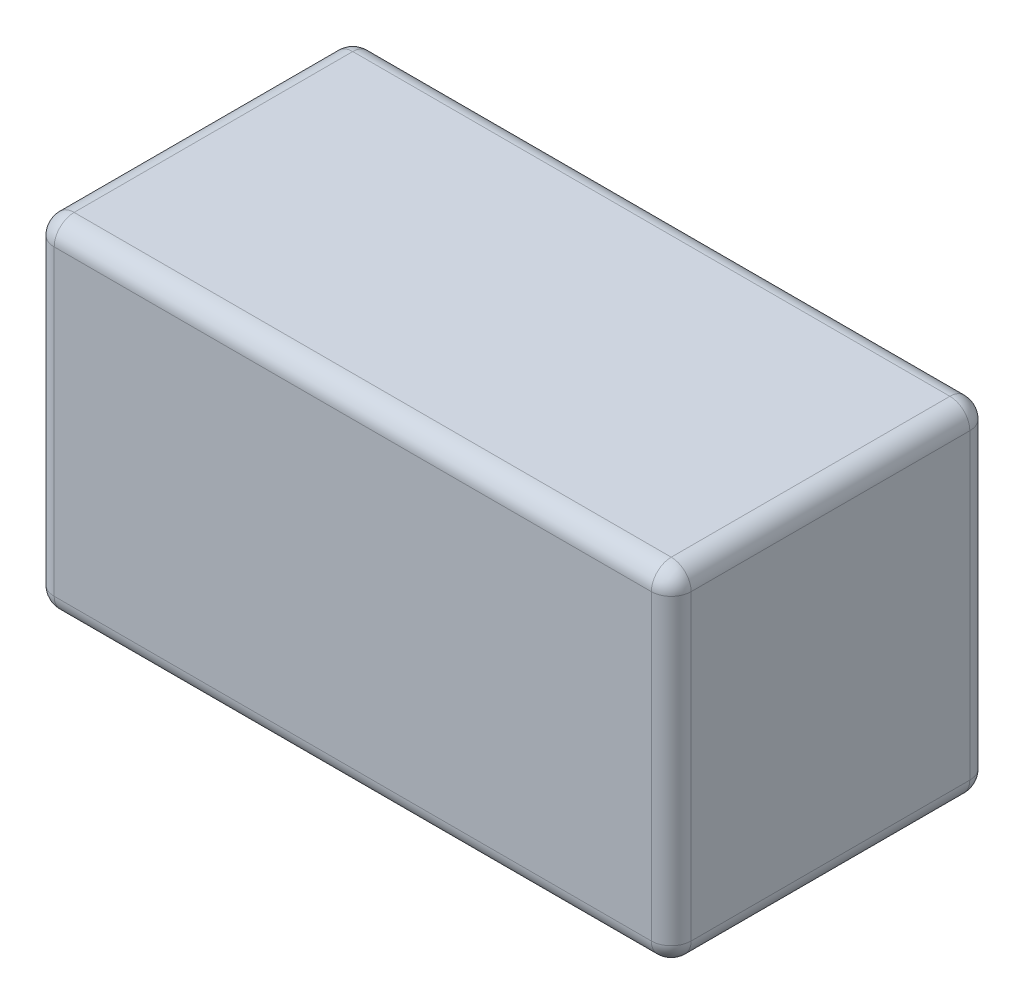
ISO-10303-21;
HEADER;
FILE_DESCRIPTION(('STEP AP214'),'2;1');
FILE_NAME('part.step','',(''),(''),'','','');
FILE_SCHEMA(('AUTOMOTIVE_DESIGN { 1 0 10303 214 1 1 1 1 }'));
ENDSEC;
DATA;
#1=APPLICATION_CONTEXT('core data for automotive mechanical design processes');
#2=APPLICATION_PROTOCOL_DEFINITION('international standard','automotive_design',2000,#1);
#3=PRODUCT_CONTEXT('',#1,'mechanical');
#4=PRODUCT('Part','Part','',(#3));
#5=PRODUCT_RELATED_PRODUCT_CATEGORY('part','',(#4));
#6=PRODUCT_DEFINITION_FORMATION('','',#4);
#7=PRODUCT_DEFINITION_CONTEXT('part definition',#1,'design');
#8=PRODUCT_DEFINITION('design','',#6,#7);
#9=PRODUCT_DEFINITION_SHAPE('','',#8);
#10=(LENGTH_UNIT() NAMED_UNIT(*) SI_UNIT(.MILLI.,.METRE.));
#11=(NAMED_UNIT(*) PLANE_ANGLE_UNIT() SI_UNIT($,.RADIAN.));
#12=(NAMED_UNIT(*) SI_UNIT($,.STERADIAN.) SOLID_ANGLE_UNIT());
#13=UNCERTAINTY_MEASURE_WITH_UNIT(LENGTH_MEASURE(1.E-05),#10,'distance_accuracy_value','');
#14=(GEOMETRIC_REPRESENTATION_CONTEXT(3) GLOBAL_UNCERTAINTY_ASSIGNED_CONTEXT((#13)) GLOBAL_UNIT_ASSIGNED_CONTEXT((#10,
#11,#12)) REPRESENTATION_CONTEXT('',''));
#15=CARTESIAN_POINT('',(0.,0.,0.));
#16=DIRECTION('',(0.,0.,1.));
#17=DIRECTION('',(1.,0.,0.));
#18=AXIS2_PLACEMENT_3D('',#15,#16,#17);
#19=CARTESIAN_POINT('',(0.75,0.81,0.35));
#20=DIRECTION('',(1.,0.,0.));
#21=DIRECTION('',(0.,0.,-1.));
#22=AXIS2_PLACEMENT_3D('',#19,#20,#21);
#23=SPHERICAL_SURFACE('',#22,0.05);
#24=CARTESIAN_POINT('',(0.75,0.81,0.35));
#25=DIRECTION('',(0.,-1.,0.));
#26=DIRECTION('',(0.,0.,-1.));
#27=AXIS2_PLACEMENT_3D('',#24,#25,#26);
#28=CIRCLE('',#27,0.05);
#29=CARTESIAN_POINT('',(0.8,0.81,0.35));
#30=VERTEX_POINT('',#29);
#31=CARTESIAN_POINT('',(0.75,0.81,0.4));
#32=VERTEX_POINT('',#31);
#33=EDGE_CURVE('E122',#30,#32,#28,.T.);
#34=ORIENTED_EDGE('',*,*,#33,.F.);
#35=CARTESIAN_POINT('',(0.75,0.81,0.35));
#36=DIRECTION('',(0.,0.,-1.));
#37=DIRECTION('',(-1.,0.,0.));
#38=AXIS2_PLACEMENT_3D('',#35,#36,#37);
#39=CIRCLE('',#38,0.05);
#40=CARTESIAN_POINT('',(0.75,0.86,0.35));
#41=VERTEX_POINT('',#40);
#42=EDGE_CURVE('E131',#41,#30,#39,.T.);
#43=ORIENTED_EDGE('',*,*,#42,.F.);
#44=CARTESIAN_POINT('',(0.75,0.81,0.35));
#45=DIRECTION('',(1.,0.,0.));
#46=DIRECTION('',(0.,0.,-1.));
#47=AXIS2_PLACEMENT_3D('',#44,#45,#46);
#48=CIRCLE('',#47,0.05);
#49=EDGE_CURVE('E111',#32,#41,#48,.F.);
#50=ORIENTED_EDGE('',*,*,#49,.F.);
#51=EDGE_LOOP('',(#34,#43,#50));
#52=FACE_BOUND('',#51,.T.);
#53=ADVANCED_FACE('F17',(#52),#23,.T.);
#54=CARTESIAN_POINT('',(-0.75,0.81,0.35));
#55=DIRECTION('',(1.,0.,0.));
#56=DIRECTION('',(0.,0.,-1.));
#57=AXIS2_PLACEMENT_3D('',#54,#55,#56);
#58=SPHERICAL_SURFACE('',#57,0.05);
#59=CARTESIAN_POINT('',(-0.75,0.81,0.35));
#60=DIRECTION('',(0.,-1.,0.));
#61=DIRECTION('',(0.,0.,-1.));
#62=AXIS2_PLACEMENT_3D('',#59,#60,#61);
#63=CIRCLE('',#62,0.05);
#64=CARTESIAN_POINT('',(-0.75,0.81,0.4));
#65=VERTEX_POINT('',#64);
#66=CARTESIAN_POINT('',(-0.8,0.81,0.35));
#67=VERTEX_POINT('',#66);
#68=EDGE_CURVE('E266',#65,#67,#63,.T.);
#69=ORIENTED_EDGE('',*,*,#68,.F.);
#70=CARTESIAN_POINT('',(-0.75,0.81,0.35));
#71=DIRECTION('',(1.,0.,0.));
#72=DIRECTION('',(0.,0.,-1.));
#73=AXIS2_PLACEMENT_3D('',#70,#71,#72);
#74=CIRCLE('',#73,0.05);
#75=CARTESIAN_POINT('',(-0.75,0.86,0.35));
#76=VERTEX_POINT('',#75);
#77=EDGE_CURVE('E114',#76,#65,#74,.T.);
#78=ORIENTED_EDGE('',*,*,#77,.F.);
#79=CARTESIAN_POINT('',(-0.75,0.81,0.35));
#80=DIRECTION('',(0.,0.,1.));
#81=DIRECTION('',(1.,0.,0.));
#82=AXIS2_PLACEMENT_3D('',#79,#80,#81);
#83=CIRCLE('',#82,0.05);
#84=EDGE_CURVE('E257',#67,#76,#83,.F.);
#85=ORIENTED_EDGE('',*,*,#84,.F.);
#86=EDGE_LOOP('',(#69,#78,#85));
#87=FACE_BOUND('',#86,.T.);
#88=ADVANCED_FACE('F151',(#87),#58,.T.);
#89=CARTESIAN_POINT('',(-0.75,0.05,0.35));
#90=DIRECTION('',(1.,0.,0.));
#91=DIRECTION('',(0.,0.,-1.));
#92=AXIS2_PLACEMENT_3D('',#89,#90,#91);
#93=SPHERICAL_SURFACE('',#92,0.05);
#94=CARTESIAN_POINT('',(-0.75,0.05,0.35));
#95=DIRECTION('',(0.,-1.,0.));
#96=DIRECTION('',(0.,0.,-1.));
#97=AXIS2_PLACEMENT_3D('',#94,#95,#96);
#98=CIRCLE('',#97,0.05);
#99=CARTESIAN_POINT('',(-0.8,0.05,0.35));
#100=VERTEX_POINT('',#99);
#101=CARTESIAN_POINT('',(-0.75,0.05,0.4));
#102=VERTEX_POINT('',#101);
#103=EDGE_CURVE('E263',#100,#102,#98,.F.);
#104=ORIENTED_EDGE('',*,*,#103,.F.);
#105=CARTESIAN_POINT('',(-0.75,0.05,0.35));
#106=DIRECTION('',(0.,0.,-1.));
#107=DIRECTION('',(-1.,0.,0.));
#108=AXIS2_PLACEMENT_3D('',#105,#106,#107);
#109=CIRCLE('',#108,0.05);
#110=CARTESIAN_POINT('',(-0.75,0.,0.35));
#111=VERTEX_POINT('',#110);
#112=EDGE_CURVE('E255',#111,#100,#109,.T.);
#113=ORIENTED_EDGE('',*,*,#112,.F.);
#114=CARTESIAN_POINT('',(-0.75,0.05,0.35));
#115=DIRECTION('',(-1.,0.,0.));
#116=DIRECTION('',(0.,0.,1.));
#117=AXIS2_PLACEMENT_3D('',#114,#115,#116);
#118=CIRCLE('',#117,0.05);
#119=EDGE_CURVE('E249',#102,#111,#118,.F.);
#120=ORIENTED_EDGE('',*,*,#119,.F.);
#121=EDGE_LOOP('',(#104,#113,#120));
#122=FACE_BOUND('',#121,.T.);
#123=ADVANCED_FACE('F147',(#122),#93,.T.);
#124=CARTESIAN_POINT('',(0.75,0.05,0.35));
#125=DIRECTION('',(1.,0.,0.));
#126=DIRECTION('',(0.,0.,-1.));
#127=AXIS2_PLACEMENT_3D('',#124,#125,#126);
#128=SPHERICAL_SURFACE('',#127,0.05);
#129=CARTESIAN_POINT('',(0.75,0.05,0.35));
#130=DIRECTION('',(-1.,0.,0.));
#131=DIRECTION('',(0.,0.,1.));
#132=AXIS2_PLACEMENT_3D('',#129,#130,#131);
#133=CIRCLE('',#132,0.05);
#134=CARTESIAN_POINT('',(0.75,0.,0.35));
#135=VERTEX_POINT('',#134);
#136=CARTESIAN_POINT('',(0.75,0.050000000000006,0.4));
#137=VERTEX_POINT('',#136);
#138=EDGE_CURVE('E247',#135,#137,#133,.T.);
#139=ORIENTED_EDGE('',*,*,#138,.F.);
#140=CARTESIAN_POINT('',(0.75,0.05,0.35));
#141=DIRECTION('',(0.,0.,1.));
#142=DIRECTION('',(1.,0.,0.));
#143=AXIS2_PLACEMENT_3D('',#140,#141,#142);
#144=CIRCLE('',#143,0.05);
#145=CARTESIAN_POINT('',(0.8,0.05,0.35));
#146=VERTEX_POINT('',#145);
#147=EDGE_CURVE('E252',#146,#135,#144,.F.);
#148=ORIENTED_EDGE('',*,*,#147,.F.);
#149=CARTESIAN_POINT('',(0.75,0.05,0.35));
#150=DIRECTION('',(0.,-1.,0.));
#151=DIRECTION('',(0.,0.,-1.));
#152=AXIS2_PLACEMENT_3D('',#149,#150,#151);
#153=CIRCLE('',#152,0.05);
#154=EDGE_CURVE('E133',#137,#146,#153,.F.);
#155=ORIENTED_EDGE('',*,*,#154,.F.);
#156=EDGE_LOOP('',(#139,#148,#155));
#157=FACE_BOUND('',#156,.T.);
#158=ADVANCED_FACE('F143',(#157),#128,.T.);
#159=CARTESIAN_POINT('',(0.75,0.86,0.35));
#160=DIRECTION('',(0.,-1.,0.));
#161=DIRECTION('',(0.,0.,-1.));
#162=AXIS2_PLACEMENT_3D('',#159,#160,#161);
#163=CYLINDRICAL_SURFACE('',#162,0.05);
#164=ORIENTED_EDGE('',*,*,#154,.T.);
#165=DIRECTION('',(0.,1.,0.));
#166=VECTOR('',#165,1.);
#167=CARTESIAN_POINT('',(0.8,0.86,0.35));
#168=LINE('',#167,#166);
#169=EDGE_CURVE('E127',#146,#30,#168,.T.);
#170=ORIENTED_EDGE('',*,*,#169,.T.);
#171=ORIENTED_EDGE('',*,*,#33,.T.);
#172=DIRECTION('',(0.,-1.,0.));
#173=VECTOR('',#172,1.);
#174=CARTESIAN_POINT('',(0.75,0.86,0.4));
#175=LINE('',#174,#173);
#176=EDGE_CURVE('E124',#32,#137,#175,.T.);
#177=ORIENTED_EDGE('',*,*,#176,.T.);
#178=EDGE_LOOP('',(#164,#170,#171,#177));
#179=FACE_BOUND('',#178,.T.);
#180=ADVANCED_FACE('F123',(#179),#163,.T.);
#181=CARTESIAN_POINT('',(0.75,0.81,-0.4));
#182=DIRECTION('',(0.,0.,-1.));
#183=DIRECTION('',(-1.,0.,0.));
#184=AXIS2_PLACEMENT_3D('',#181,#182,#183);
#185=CYLINDRICAL_SURFACE('',#184,0.05);
#186=CARTESIAN_POINT('',(0.75,0.81,-0.35));
#187=DIRECTION('',(0.,0.,1.));
#188=DIRECTION('',(1.,0.,0.));
#189=AXIS2_PLACEMENT_3D('',#186,#187,#188);
#190=CIRCLE('',#189,0.05);
#191=CARTESIAN_POINT('',(0.75,0.86,-0.35));
#192=VERTEX_POINT('',#191);
#193=CARTESIAN_POINT('',(0.8,0.81,-0.35));
#194=VERTEX_POINT('',#193);
#195=EDGE_CURVE('E238',#192,#194,#190,.F.);
#196=ORIENTED_EDGE('',*,*,#195,.F.);
#197=DIRECTION('',(0.,0.,-1.));
#198=VECTOR('',#197,1.);
#199=CARTESIAN_POINT('',(0.75,0.86,-0.4));
#200=LINE('',#199,#198);
#201=EDGE_CURVE('E116',#192,#41,#200,.F.);
#202=ORIENTED_EDGE('',*,*,#201,.T.);
#203=ORIENTED_EDGE('',*,*,#42,.T.);
#204=DIRECTION('',(0.,0.,1.));
#205=VECTOR('',#204,1.);
#206=CARTESIAN_POINT('',(0.8,0.81,0.4));
#207=LINE('',#206,#205);
#208=EDGE_CURVE('E117',#30,#194,#207,.F.);
#209=ORIENTED_EDGE('',*,*,#208,.T.);
#210=EDGE_LOOP('',(#196,#202,#203,#209));
#211=FACE_BOUND('',#210,.T.);
#212=ADVANCED_FACE('F271',(#211),#185,.T.);
#213=CARTESIAN_POINT('',(-0.75,0.86,0.35));
#214=DIRECTION('',(0.,-1.,0.));
#215=DIRECTION('',(0.,0.,-1.));
#216=AXIS2_PLACEMENT_3D('',#213,#214,#215);
#217=CYLINDRICAL_SURFACE('',#216,0.05);
#218=ORIENTED_EDGE('',*,*,#103,.T.);
#219=DIRECTION('',(0.,-1.,0.));
#220=VECTOR('',#219,1.);
#221=CARTESIAN_POINT('',(-0.75,0.86,0.4));
#222=LINE('',#221,#220);
#223=EDGE_CURVE('E260',#102,#65,#222,.F.);
#224=ORIENTED_EDGE('',*,*,#223,.T.);
#225=ORIENTED_EDGE('',*,*,#68,.T.);
#226=DIRECTION('',(0.,1.,0.));
#227=VECTOR('',#226,1.);
#228=CARTESIAN_POINT('',(-0.8,0.86,0.35));
#229=LINE('',#228,#227);
#230=EDGE_CURVE('E355',#67,#100,#229,.F.);
#231=ORIENTED_EDGE('',*,*,#230,.T.);
#232=EDGE_LOOP('',(#218,#224,#225,#231));
#233=FACE_BOUND('',#232,.T.);
#234=ADVANCED_FACE('F360',(#233),#217,.T.);
#235=CARTESIAN_POINT('',(-0.75,0.81,-0.4));
#236=DIRECTION('',(0.,0.,1.));
#237=DIRECTION('',(1.,0.,0.));
#238=AXIS2_PLACEMENT_3D('',#235,#236,#237);
#239=CYLINDRICAL_SURFACE('',#238,0.05);
#240=CARTESIAN_POINT('',(-0.75,0.81,-0.35));
#241=DIRECTION('',(0.,3.83299520255585E-12,1.));
#242=DIRECTION('',(1.,0.,0.));
#243=AXIS2_PLACEMENT_3D('',#240,#241,#242);
#244=CIRCLE('',#243,0.05);
#245=CARTESIAN_POINT('',(-0.8,0.81,-0.35));
#246=VERTEX_POINT('',#245);
#247=CARTESIAN_POINT('',(-0.75,0.86,-0.350000000000024));
#248=VERTEX_POINT('',#247);
#249=EDGE_CURVE('E215',#246,#248,#244,.F.);
#250=ORIENTED_EDGE('',*,*,#249,.F.);
#251=DIRECTION('',(0.,0.,-1.));
#252=VECTOR('',#251,1.);
#253=CARTESIAN_POINT('',(-0.8,0.81,0.4));
#254=LINE('',#253,#252);
#255=EDGE_CURVE('E357',#246,#67,#254,.F.);
#256=ORIENTED_EDGE('',*,*,#255,.T.);
#257=ORIENTED_EDGE('',*,*,#84,.T.);
#258=DIRECTION('',(0.,0.,-1.));
#259=VECTOR('',#258,1.);
#260=CARTESIAN_POINT('',(-0.75,0.86,-0.4));
#261=LINE('',#260,#259);
#262=EDGE_CURVE('E236',#76,#248,#261,.T.);
#263=ORIENTED_EDGE('',*,*,#262,.T.);
#264=EDGE_LOOP('',(#250,#256,#257,#263));
#265=FACE_BOUND('',#264,.T.);
#266=ADVANCED_FACE('F363',(#265),#239,.T.);
#267=CARTESIAN_POINT('',(-0.75,0.05,0.4));
#268=DIRECTION('',(0.,0.,-1.));
#269=DIRECTION('',(-1.,0.,0.));
#270=AXIS2_PLACEMENT_3D('',#267,#268,#269);
#271=CYLINDRICAL_SURFACE('',#270,0.05);
#272=CARTESIAN_POINT('',(-0.75,0.05,-0.35));
#273=DIRECTION('',(0.,0.,-1.));
#274=DIRECTION('',(1.,0.,0.));
#275=AXIS2_PLACEMENT_3D('',#272,#273,#274);
#276=CIRCLE('',#275,0.05);
#277=CARTESIAN_POINT('',(-0.75,0.,-0.35));
#278=VERTEX_POINT('',#277);
#279=CARTESIAN_POINT('',(-0.8,0.05,-0.35));
#280=VERTEX_POINT('',#279);
#281=EDGE_CURVE('E211',#278,#280,#276,.T.);
#282=ORIENTED_EDGE('',*,*,#281,.F.);
#283=DIRECTION('',(0.,0.,-1.));
#284=VECTOR('',#283,1.);
#285=CARTESIAN_POINT('',(-0.75,0.,-0.4));
#286=LINE('',#285,#284);
#287=EDGE_CURVE('E207',#111,#278,#286,.T.);
#288=ORIENTED_EDGE('',*,*,#287,.F.);
#289=ORIENTED_EDGE('',*,*,#112,.T.);
#290=DIRECTION('',(0.,0.,-1.));
#291=VECTOR('',#290,1.);
#292=CARTESIAN_POINT('',(-0.8,0.05,0.4));
#293=LINE('',#292,#291);
#294=EDGE_CURVE('E309',#100,#280,#293,.T.);
#295=ORIENTED_EDGE('',*,*,#294,.T.);
#296=EDGE_LOOP('',(#282,#288,#289,#295));
#297=FACE_BOUND('',#296,.T.);
#298=ADVANCED_FACE('F307',(#297),#271,.T.);
#299=CARTESIAN_POINT('',(0.75,0.05,0.4));
#300=DIRECTION('',(0.,0.,1.));
#301=DIRECTION('',(1.,0.,0.));
#302=AXIS2_PLACEMENT_3D('',#299,#300,#301);
#303=CYLINDRICAL_SURFACE('',#302,0.05);
#304=CARTESIAN_POINT('',(0.75,0.05,-0.35));
#305=DIRECTION('',(0.,0.,-1.));
#306=DIRECTION('',(1.,0.,0.));
#307=AXIS2_PLACEMENT_3D('',#304,#305,#306);
#308=CIRCLE('',#307,0.05);
#309=CARTESIAN_POINT('',(0.8,0.05,-0.35));
#310=VERTEX_POINT('',#309);
#311=CARTESIAN_POINT('',(0.75,0.,-0.35));
#312=VERTEX_POINT('',#311);
#313=EDGE_CURVE('E209',#310,#312,#308,.T.);
#314=ORIENTED_EDGE('',*,*,#313,.F.);
#315=DIRECTION('',(0.,0.,1.));
#316=VECTOR('',#315,1.);
#317=CARTESIAN_POINT('',(0.8,0.05,0.4));
#318=LINE('',#317,#316);
#319=EDGE_CURVE('E244',#310,#146,#318,.T.);
#320=ORIENTED_EDGE('',*,*,#319,.T.);
#321=ORIENTED_EDGE('',*,*,#147,.T.);
#322=DIRECTION('',(0.,0.,-1.));
#323=VECTOR('',#322,1.);
#324=CARTESIAN_POINT('',(0.75,0.,-0.4));
#325=LINE('',#324,#323);
#326=EDGE_CURVE('E296',#312,#135,#325,.F.);
#327=ORIENTED_EDGE('',*,*,#326,.F.);
#328=EDGE_LOOP('',(#314,#320,#321,#327));
#329=FACE_BOUND('',#328,.T.);
#330=ADVANCED_FACE('F346',(#329),#303,.T.);
#331=CARTESIAN_POINT('',(-0.8,0.86,0.4));
#332=DIRECTION('',(0.,0.,-1.));
#333=DIRECTION('',(-1.,0.,0.));
#334=AXIS2_PLACEMENT_3D('',#331,#332,#333);
#335=PLANE('',#334);
#336=DIRECTION('',(1.,0.,0.));
#337=VECTOR('',#336,1.);
#338=CARTESIAN_POINT('',(0.8,0.81,0.4));
#339=LINE('',#338,#337);
#340=EDGE_CURVE('E107',#65,#32,#339,.T.);
#341=ORIENTED_EDGE('',*,*,#340,.F.);
#342=ORIENTED_EDGE('',*,*,#223,.F.);
#343=DIRECTION('',(-1.,0.,0.));
#344=VECTOR('',#343,1.);
#345=CARTESIAN_POINT('',(-0.8,0.05,0.4));
#346=LINE('',#345,#344);
#347=EDGE_CURVE('E101',#137,#102,#346,.T.);
#348=ORIENTED_EDGE('',*,*,#347,.F.);
#349=ORIENTED_EDGE('',*,*,#176,.F.);
#350=EDGE_LOOP('',(#341,#342,#348,#349));
#351=FACE_BOUND('',#350,.T.);
#352=ADVANCED_FACE('F135',(#351),#335,.F.);
#353=CARTESIAN_POINT('',(0.8,0.86,0.4));
#354=DIRECTION('',(-1.,0.,0.));
#355=DIRECTION('',(0.,0.,1.));
#356=AXIS2_PLACEMENT_3D('',#353,#354,#355);
#357=PLANE('',#356);
#358=ORIENTED_EDGE('',*,*,#208,.F.);
#359=ORIENTED_EDGE('',*,*,#169,.F.);
#360=ORIENTED_EDGE('',*,*,#319,.F.);
#361=DIRECTION('',(0.,-1.,0.));
#362=VECTOR('',#361,1.);
#363=CARTESIAN_POINT('',(0.8,0.86,-0.35));
#364=LINE('',#363,#362);
#365=EDGE_CURVE('E287',#194,#310,#364,.T.);
#366=ORIENTED_EDGE('',*,*,#365,.F.);
#367=EDGE_LOOP('',(#358,#359,#360,#366));
#368=FACE_BOUND('',#367,.T.);
#369=ADVANCED_FACE('F515',(#368),#357,.F.);
#370=CARTESIAN_POINT('',(0.8,0.81,0.35));
#371=DIRECTION('',(1.,0.,0.));
#372=DIRECTION('',(0.,0.,-1.));
#373=AXIS2_PLACEMENT_3D('',#370,#371,#372);
#374=CYLINDRICAL_SURFACE('',#373,0.05);
#375=ORIENTED_EDGE('',*,*,#340,.T.);
#376=ORIENTED_EDGE('',*,*,#49,.T.);
#377=DIRECTION('',(1.,0.,0.));
#378=VECTOR('',#377,1.);
#379=CARTESIAN_POINT('',(0.8,0.86,0.35));
#380=LINE('',#379,#378);
#381=EDGE_CURVE('E278',#41,#76,#380,.F.);
#382=ORIENTED_EDGE('',*,*,#381,.T.);
#383=ORIENTED_EDGE('',*,*,#77,.T.);
#384=EDGE_LOOP('',(#375,#376,#382,#383));
#385=FACE_BOUND('',#384,.T.);
#386=ADVANCED_FACE('F109',(#385),#374,.T.);
#387=CARTESIAN_POINT('',(0.75,0.81,-0.35));
#388=DIRECTION('',(1.,0.,0.));
#389=DIRECTION('',(0.,0.,-1.));
#390=AXIS2_PLACEMENT_3D('',#387,#388,#389);
#391=SPHERICAL_SURFACE('',#390,0.05);
#392=ORIENTED_EDGE('',*,*,#195,.T.);
#393=CARTESIAN_POINT('',(0.75,0.81,-0.35));
#394=DIRECTION('',(0.,-1.,0.));
#395=DIRECTION('',(0.,0.,-1.));
#396=AXIS2_PLACEMENT_3D('',#393,#394,#395);
#397=CIRCLE('',#396,0.05);
#398=CARTESIAN_POINT('',(0.75,0.81,-0.4));
#399=VERTEX_POINT('',#398);
#400=EDGE_CURVE('E293',#399,#194,#397,.T.);
#401=ORIENTED_EDGE('',*,*,#400,.F.);
#402=CARTESIAN_POINT('',(0.75,0.81,-0.35));
#403=DIRECTION('',(-1.,0.,0.));
#404=DIRECTION('',(0.,0.,1.));
#405=AXIS2_PLACEMENT_3D('',#402,#403,#404);
#406=CIRCLE('',#405,0.05);
#407=EDGE_CURVE('E280',#192,#399,#406,.T.);
#408=ORIENTED_EDGE('',*,*,#407,.F.);
#409=EDGE_LOOP('',(#392,#401,#408));
#410=FACE_BOUND('',#409,.T.);
#411=ADVANCED_FACE('F226',(#410),#391,.T.);
#412=CARTESIAN_POINT('',(-0.8,0.86,0.4));
#413=DIRECTION('',(1.,0.,0.));
#414=DIRECTION('',(0.,0.,-1.));
#415=AXIS2_PLACEMENT_3D('',#412,#413,#414);
#416=PLANE('',#415);
#417=ORIENTED_EDGE('',*,*,#255,.F.);
#418=DIRECTION('',(0.,-1.,0.));
#419=VECTOR('',#418,1.);
#420=CARTESIAN_POINT('',(-0.8,0.86,-0.35));
#421=LINE('',#420,#419);
#422=EDGE_CURVE('E323',#280,#246,#421,.F.);
#423=ORIENTED_EDGE('',*,*,#422,.F.);
#424=ORIENTED_EDGE('',*,*,#294,.F.);
#425=ORIENTED_EDGE('',*,*,#230,.F.);
#426=EDGE_LOOP('',(#417,#423,#424,#425));
#427=FACE_BOUND('',#426,.T.);
#428=ADVANCED_FACE('F222',(#427),#416,.F.);
#429=CARTESIAN_POINT('',(-0.75,0.81,-0.35));
#430=DIRECTION('',(1.,0.,0.));
#431=DIRECTION('',(0.,0.,-1.));
#432=AXIS2_PLACEMENT_3D('',#429,#430,#431);
#433=SPHERICAL_SURFACE('',#432,0.05);
#434=ORIENTED_EDGE('',*,*,#249,.T.);
#435=CARTESIAN_POINT('',(-0.75,0.81,-0.35));
#436=DIRECTION('',(-1.,0.,0.));
#437=DIRECTION('',(0.,0.,1.));
#438=AXIS2_PLACEMENT_3D('',#435,#436,#437);
#439=CIRCLE('',#438,0.05);
#440=CARTESIAN_POINT('',(-0.75,0.81,-0.4));
#441=VERTEX_POINT('',#440);
#442=EDGE_CURVE('E284',#441,#248,#439,.F.);
#443=ORIENTED_EDGE('',*,*,#442,.F.);
#444=CARTESIAN_POINT('',(-0.75,0.81,-0.35));
#445=DIRECTION('',(0.,-1.,0.));
#446=DIRECTION('',(0.,0.,-1.));
#447=AXIS2_PLACEMENT_3D('',#444,#445,#446);
#448=CIRCLE('',#447,0.05);
#449=EDGE_CURVE('E318',#246,#441,#448,.T.);
#450=ORIENTED_EDGE('',*,*,#449,.F.);
#451=EDGE_LOOP('',(#434,#443,#450));
#452=FACE_BOUND('',#451,.T.);
#453=ADVANCED_FACE('F219',(#452),#433,.T.);
#454=CARTESIAN_POINT('',(-0.75,0.05,-0.35));
#455=DIRECTION('',(1.,0.,0.));
#456=DIRECTION('',(0.,0.,-1.));
#457=AXIS2_PLACEMENT_3D('',#454,#455,#456);
#458=SPHERICAL_SURFACE('',#457,0.05);
#459=CARTESIAN_POINT('',(-0.75,0.05,-0.35));
#460=DIRECTION('',(0.,-1.,0.));
#461=DIRECTION('',(0.,0.,-1.));
#462=AXIS2_PLACEMENT_3D('',#459,#460,#461);
#463=CIRCLE('',#462,0.05);
#464=CARTESIAN_POINT('',(-0.75,0.05,-0.4));
#465=VERTEX_POINT('',#464);
#466=EDGE_CURVE('E315',#465,#280,#463,.F.);
#467=ORIENTED_EDGE('',*,*,#466,.F.);
#468=CARTESIAN_POINT('',(-0.75,0.05,-0.35));
#469=DIRECTION('',(1.,0.,0.));
#470=DIRECTION('',(0.,0.,-1.));
#471=AXIS2_PLACEMENT_3D('',#468,#469,#470);
#472=CIRCLE('',#471,0.05);
#473=EDGE_CURVE('E314',#278,#465,#472,.T.);
#474=ORIENTED_EDGE('',*,*,#473,.F.);
#475=ORIENTED_EDGE('',*,*,#281,.T.);
#476=EDGE_LOOP('',(#467,#474,#475));
#477=FACE_BOUND('',#476,.T.);
#478=ADVANCED_FACE('F200',(#477),#458,.T.);
#479=CARTESIAN_POINT('',(0.75,0.05,-0.35));
#480=DIRECTION('',(1.,0.,0.));
#481=DIRECTION('',(0.,0.,-1.));
#482=AXIS2_PLACEMENT_3D('',#479,#480,#481);
#483=SPHERICAL_SURFACE('',#482,0.05);
#484=CARTESIAN_POINT('',(0.75,0.05,-0.35));
#485=DIRECTION('',(1.,0.,0.));
#486=DIRECTION('',(0.,0.,-1.));
#487=AXIS2_PLACEMENT_3D('',#484,#485,#486);
#488=CIRCLE('',#487,0.05);
#489=CARTESIAN_POINT('',(0.75,0.05,-0.4));
#490=VERTEX_POINT('',#489);
#491=EDGE_CURVE('E317',#490,#312,#488,.F.);
#492=ORIENTED_EDGE('',*,*,#491,.F.);
#493=CARTESIAN_POINT('',(0.75,0.05,-0.35));
#494=DIRECTION('',(0.,-1.,0.));
#495=DIRECTION('',(0.,0.,-1.));
#496=AXIS2_PLACEMENT_3D('',#493,#494,#495);
#497=CIRCLE('',#496,0.05);
#498=EDGE_CURVE('E281',#310,#490,#497,.F.);
#499=ORIENTED_EDGE('',*,*,#498,.F.);
#500=ORIENTED_EDGE('',*,*,#313,.T.);
#501=EDGE_LOOP('',(#492,#499,#500));
#502=FACE_BOUND('',#501,.T.);
#503=ADVANCED_FACE('F195',(#502),#483,.T.);
#504=CARTESIAN_POINT('',(-0.8,0.05,0.35));
#505=DIRECTION('',(-1.,0.,0.));
#506=DIRECTION('',(0.,0.,1.));
#507=AXIS2_PLACEMENT_3D('',#504,#505,#506);
#508=CYLINDRICAL_SURFACE('',#507,0.05);
#509=DIRECTION('',(1.,0.,0.));
#510=VECTOR('',#509,1.);
#511=CARTESIAN_POINT('',(0.8,0.,0.35));
#512=LINE('',#511,#510);
#513=EDGE_CURVE('E303',#135,#111,#512,.F.);
#514=ORIENTED_EDGE('',*,*,#513,.F.);
#515=ORIENTED_EDGE('',*,*,#138,.T.);
#516=ORIENTED_EDGE('',*,*,#347,.T.);
#517=ORIENTED_EDGE('',*,*,#119,.T.);
#518=EDGE_LOOP('',(#514,#515,#516,#517));
#519=FACE_BOUND('',#518,.T.);
#520=ADVANCED_FACE('F191',(#519),#508,.T.);
#521=CARTESIAN_POINT('',(0.75,0.86,-0.35));
#522=DIRECTION('',(0.,-1.,0.));
#523=DIRECTION('',(0.,0.,-1.));
#524=AXIS2_PLACEMENT_3D('',#521,#522,#523);
#525=CYLINDRICAL_SURFACE('',#524,0.05);
#526=ORIENTED_EDGE('',*,*,#498,.T.);
#527=DIRECTION('',(0.,1.,0.));
#528=VECTOR('',#527,1.);
#529=CARTESIAN_POINT('',(0.75,0.86,-0.4));
#530=LINE('',#529,#528);
#531=EDGE_CURVE('E336',#490,#399,#530,.T.);
#532=ORIENTED_EDGE('',*,*,#531,.T.);
#533=ORIENTED_EDGE('',*,*,#400,.T.);
#534=ORIENTED_EDGE('',*,*,#365,.T.);
#535=EDGE_LOOP('',(#526,#532,#533,#534));
#536=FACE_BOUND('',#535,.T.);
#537=ADVANCED_FACE('F187',(#536),#525,.T.);
#538=CARTESIAN_POINT('',(0.8,0.86,-0.4));
#539=DIRECTION('',(0.,-1.,0.));
#540=DIRECTION('',(0.,0.,-1.));
#541=AXIS2_PLACEMENT_3D('',#538,#539,#540);
#542=PLANE('',#541);
#543=DIRECTION('',(-1.,0.,0.));
#544=VECTOR('',#543,1.);
#545=CARTESIAN_POINT('',(0.8,0.86,-0.35));
#546=LINE('',#545,#544);
#547=EDGE_CURVE('E276',#248,#192,#546,.F.);
#548=ORIENTED_EDGE('',*,*,#547,.F.);
#549=ORIENTED_EDGE('',*,*,#262,.F.);
#550=ORIENTED_EDGE('',*,*,#381,.F.);
#551=ORIENTED_EDGE('',*,*,#201,.F.);
#552=EDGE_LOOP('',(#548,#549,#550,#551));
#553=FACE_BOUND('',#552,.T.);
#554=ADVANCED_FACE('F183',(#553),#542,.F.);
#555=CARTESIAN_POINT('',(-0.75,0.86,-0.35));
#556=DIRECTION('',(0.,-1.,0.));
#557=DIRECTION('',(0.,0.,-1.));
#558=AXIS2_PLACEMENT_3D('',#555,#556,#557);
#559=CYLINDRICAL_SURFACE('',#558,0.05);
#560=ORIENTED_EDGE('',*,*,#449,.T.);
#561=DIRECTION('',(0.,1.,0.));
#562=VECTOR('',#561,1.);
#563=CARTESIAN_POINT('',(-0.75,0.86,-0.4));
#564=LINE('',#563,#562);
#565=EDGE_CURVE('E333',#441,#465,#564,.F.);
#566=ORIENTED_EDGE('',*,*,#565,.T.);
#567=ORIENTED_EDGE('',*,*,#466,.T.);
#568=ORIENTED_EDGE('',*,*,#422,.T.);
#569=EDGE_LOOP('',(#560,#566,#567,#568));
#570=FACE_BOUND('',#569,.T.);
#571=ADVANCED_FACE('F179',(#570),#559,.T.);
#572=CARTESIAN_POINT('',(0.8,0.,-0.4));
#573=DIRECTION('',(0.,-1.,0.));
#574=DIRECTION('',(0.,0.,-1.));
#575=AXIS2_PLACEMENT_3D('',#572,#573,#574);
#576=PLANE('',#575);
#577=DIRECTION('',(1.,0.,0.));
#578=VECTOR('',#577,1.);
#579=CARTESIAN_POINT('',(-0.8,0.,-0.35));
#580=LINE('',#579,#578);
#581=EDGE_CURVE('E302',#312,#278,#580,.F.);
#582=ORIENTED_EDGE('',*,*,#581,.F.);
#583=ORIENTED_EDGE('',*,*,#326,.T.);
#584=ORIENTED_EDGE('',*,*,#513,.T.);
#585=ORIENTED_EDGE('',*,*,#287,.T.);
#586=EDGE_LOOP('',(#582,#583,#584,#585));
#587=FACE_BOUND('',#586,.T.);
#588=ADVANCED_FACE('F175',(#587),#576,.T.);
#589=CARTESIAN_POINT('',(0.8,0.81,-0.35));
#590=DIRECTION('',(-1.,0.,0.));
#591=DIRECTION('',(0.,0.,1.));
#592=AXIS2_PLACEMENT_3D('',#589,#590,#591);
#593=CYLINDRICAL_SURFACE('',#592,0.05);
#594=ORIENTED_EDGE('',*,*,#547,.T.);
#595=ORIENTED_EDGE('',*,*,#407,.T.);
#596=DIRECTION('',(1.,0.,0.));
#597=VECTOR('',#596,1.);
#598=CARTESIAN_POINT('',(-0.8,0.81,-0.4));
#599=LINE('',#598,#597);
#600=EDGE_CURVE('E26',#399,#441,#599,.F.);
#601=ORIENTED_EDGE('',*,*,#600,.T.);
#602=ORIENTED_EDGE('',*,*,#442,.T.);
#603=EDGE_LOOP('',(#594,#595,#601,#602));
#604=FACE_BOUND('',#603,.T.);
#605=ADVANCED_FACE('F169',(#604),#593,.T.);
#606=CARTESIAN_POINT('',(-0.8,0.05,-0.35));
#607=DIRECTION('',(1.,0.,0.));
#608=DIRECTION('',(0.,0.,-1.));
#609=AXIS2_PLACEMENT_3D('',#606,#607,#608);
#610=CYLINDRICAL_SURFACE('',#609,0.05);
#611=DIRECTION('',(1.,0.,0.));
#612=VECTOR('',#611,1.);
#613=CARTESIAN_POINT('',(-0.8,0.05,-0.4));
#614=LINE('',#613,#612);
#615=EDGE_CURVE('E11',#465,#490,#614,.T.);
#616=ORIENTED_EDGE('',*,*,#615,.T.);
#617=ORIENTED_EDGE('',*,*,#491,.T.);
#618=ORIENTED_EDGE('',*,*,#581,.T.);
#619=ORIENTED_EDGE('',*,*,#473,.T.);
#620=EDGE_LOOP('',(#616,#617,#618,#619));
#621=FACE_BOUND('',#620,.T.);
#622=ADVANCED_FACE('F163',(#621),#610,.T.);
#623=CARTESIAN_POINT('',(-0.8,0.86,-0.4));
#624=DIRECTION('',(0.,0.,1.));
#625=DIRECTION('',(1.,0.,0.));
#626=AXIS2_PLACEMENT_3D('',#623,#624,#625);
#627=PLANE('',#626);
#628=ORIENTED_EDGE('',*,*,#615,.F.);
#629=ORIENTED_EDGE('',*,*,#565,.F.);
#630=ORIENTED_EDGE('',*,*,#600,.F.);
#631=ORIENTED_EDGE('',*,*,#531,.F.);
#632=EDGE_LOOP('',(#628,#629,#630,#631));
#633=FACE_BOUND('',#632,.T.);
#634=ADVANCED_FACE('F161',(#633),#627,.F.);
#635=CLOSED_SHELL('',(#53,#88,#123,#158,#180,#212,#234,#266,#298,#330,#352,#369,#386,#411,#428,
#453,#478,#503,#520,#537,#554,#571,#588,#605,#622,#634));
#636=MANIFOLD_SOLID_BREP('B1',#635);
#637=ADVANCED_BREP_SHAPE_REPRESENTATION('',(#18,#636),#14);
#638=SHAPE_DEFINITION_REPRESENTATION(#9,#637);
ENDSEC;
END-ISO-10303-21;
